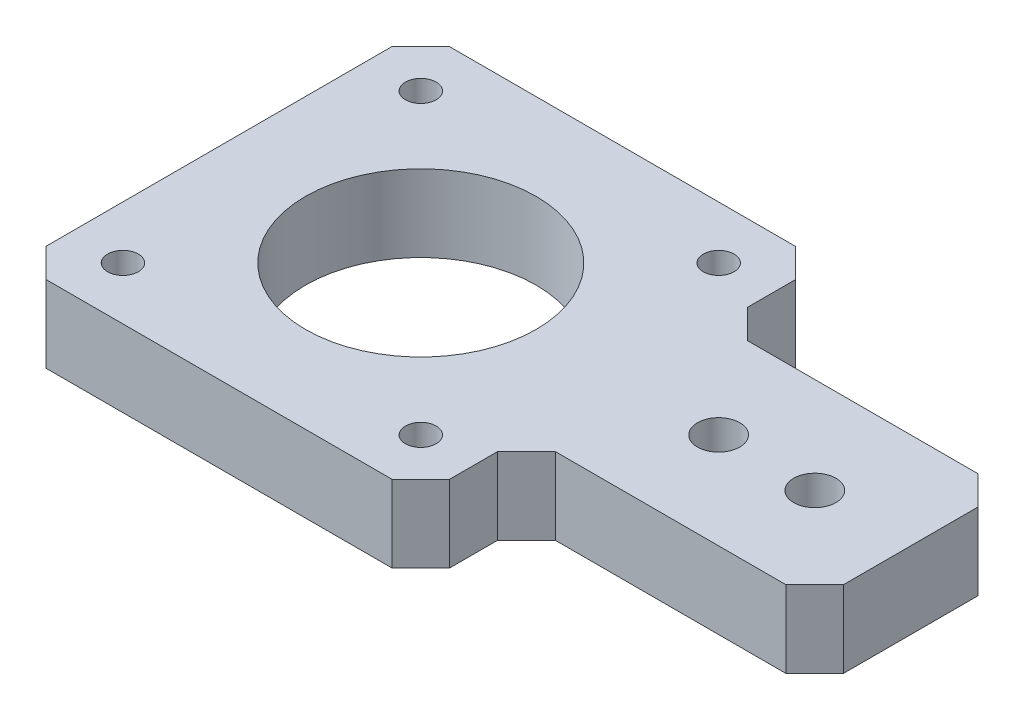
ISO-10303-21;
HEADER;
FILE_DESCRIPTION(('STEP AP214'),'2;1');
FILE_NAME('part.step','',(''),(''),'','','');
FILE_SCHEMA(('AUTOMOTIVE_DESIGN { 1 0 10303 214 1 1 1 1 }'));
ENDSEC;
DATA;
#1=APPLICATION_CONTEXT('core data for automotive mechanical design processes');
#2=APPLICATION_PROTOCOL_DEFINITION('international standard','automotive_design',2000,#1);
#3=PRODUCT_CONTEXT('',#1,'mechanical');
#4=PRODUCT('Part','Part','',(#3));
#5=PRODUCT_RELATED_PRODUCT_CATEGORY('part','',(#4));
#6=PRODUCT_DEFINITION_FORMATION('','',#4);
#7=PRODUCT_DEFINITION_CONTEXT('part definition',#1,'design');
#8=PRODUCT_DEFINITION('design','',#6,#7);
#9=PRODUCT_DEFINITION_SHAPE('','',#8);
#10=(LENGTH_UNIT() NAMED_UNIT(*) SI_UNIT(.MILLI.,.METRE.));
#11=(NAMED_UNIT(*) PLANE_ANGLE_UNIT() SI_UNIT($,.RADIAN.));
#12=(NAMED_UNIT(*) SI_UNIT($,.STERADIAN.) SOLID_ANGLE_UNIT());
#13=UNCERTAINTY_MEASURE_WITH_UNIT(LENGTH_MEASURE(1.E-05),#10,'distance_accuracy_value','');
#14=(GEOMETRIC_REPRESENTATION_CONTEXT(3) GLOBAL_UNCERTAINTY_ASSIGNED_CONTEXT((#13)) GLOBAL_UNIT_ASSIGNED_CONTEXT((#10,
#11,#12)) REPRESENTATION_CONTEXT('',''));
#15=CARTESIAN_POINT('',(0.,0.,0.));
#16=DIRECTION('',(0.,0.,1.));
#17=DIRECTION('',(1.,0.,0.));
#18=AXIS2_PLACEMENT_3D('',#15,#16,#17);
#19=CARTESIAN_POINT('',(0.,8.,0.));
#20=DIRECTION('',(0.,1.,0.));
#21=DIRECTION('',(0.,0.,1.));
#22=AXIS2_PLACEMENT_3D('',#19,#20,#21);
#23=PLANE('',#22);
#24=CARTESIAN_POINT('',(30.9981350751792,8.,0.00373449553807588));
#25=DIRECTION('',(0.,1.,0.));
#26=DIRECTION('',(0.,0.,1.));
#27=AXIS2_PLACEMENT_3D('',#24,#25,#26);
#28=CIRCLE('',#27,2.2);
#29=CARTESIAN_POINT('',(30.9981350751792,8.,2.20373449553807));
#30=VERTEX_POINT('',#29);
#31=EDGE_CURVE('E355',#30,#30,#28,.T.);
#32=ORIENTED_EDGE('',*,*,#31,.F.);
#33=EDGE_LOOP('',(#32));
#34=FACE_BOUND('',#33,.T.);
#35=CARTESIAN_POINT('',(15.5,8.,-15.5));
#36=DIRECTION('',(0.,1.,0.));
#37=DIRECTION('',(0.,0.,1.));
#38=AXIS2_PLACEMENT_3D('',#35,#36,#37);
#39=CIRCLE('',#38,1.6);
#40=CARTESIAN_POINT('',(15.5,8.,-13.9));
#41=VERTEX_POINT('',#40);
#42=EDGE_CURVE('E367',#41,#41,#39,.T.);
#43=ORIENTED_EDGE('',*,*,#42,.F.);
#44=EDGE_LOOP('',(#43));
#45=FACE_BOUND('',#44,.T.);
#46=CARTESIAN_POINT('',(-15.5,8.,15.5));
#47=DIRECTION('',(0.,1.,0.));
#48=DIRECTION('',(0.,0.,1.));
#49=AXIS2_PLACEMENT_3D('',#46,#47,#48);
#50=CIRCLE('',#49,1.6);
#51=CARTESIAN_POINT('',(-15.5,8.,17.1));
#52=VERTEX_POINT('',#51);
#53=EDGE_CURVE('E379',#52,#52,#50,.T.);
#54=ORIENTED_EDGE('',*,*,#53,.F.);
#55=EDGE_LOOP('',(#54));
#56=FACE_BOUND('',#55,.T.);
#57=DIRECTION('',(1.,0.,0.));
#58=VECTOR('',#57,1.);
#59=CARTESIAN_POINT('',(-18.,8.,21.));
#60=LINE('',#59,#58);
#61=CARTESIAN_POINT('',(-18.,8.,21.));
#62=VERTEX_POINT('',#61);
#63=CARTESIAN_POINT('',(18.,8.,21.));
#64=VERTEX_POINT('',#63);
#65=EDGE_CURVE('E209',#62,#64,#60,.T.);
#66=ORIENTED_EDGE('',*,*,#65,.T.);
#67=DIRECTION('',(0.707106781186547,0.,-0.707106781186548));
#68=VECTOR('',#67,1.);
#69=CARTESIAN_POINT('',(18.,8.,21.));
#70=LINE('',#69,#68);
#71=CARTESIAN_POINT('',(20.998132752231,8.,18.001867247769));
#72=VERTEX_POINT('',#71);
#73=EDGE_CURVE('E117',#64,#72,#70,.T.);
#74=ORIENTED_EDGE('',*,*,#73,.T.);
#75=DIRECTION('',(0.,0.,-1.));
#76=VECTOR('',#75,1.);
#77=CARTESIAN_POINT('',(20.998132752231,8.,18.001867247769));
#78=LINE('',#77,#76);
#79=CARTESIAN_POINT('',(20.9981327522309,8.,13.001867247769));
#80=VERTEX_POINT('',#79);
#81=EDGE_CURVE('E248',#72,#80,#78,.T.);
#82=ORIENTED_EDGE('',*,*,#81,.T.);
#83=DIRECTION('',(0.707106781186545,0.,-0.70710678118655));
#84=VECTOR('',#83,1.);
#85=CARTESIAN_POINT('',(20.9981327522309,8.,13.001867247769));
#86=LINE('',#85,#84);
#87=CARTESIAN_POINT('',(23.9962655044619,8.,10.003734495538));
#88=VERTEX_POINT('',#87);
#89=EDGE_CURVE('E267',#80,#88,#86,.T.);
#90=ORIENTED_EDGE('',*,*,#89,.T.);
#91=DIRECTION('',(1.,0.,0.));
#92=VECTOR('',#91,1.);
#93=CARTESIAN_POINT('',(23.9962655044619,8.,10.003734495538));
#94=LINE('',#93,#92);
#95=CARTESIAN_POINT('',(47.9962655044619,8.,10.003734495538));
#96=VERTEX_POINT('',#95);
#97=EDGE_CURVE('E264',#88,#96,#94,.T.);
#98=ORIENTED_EDGE('',*,*,#97,.T.);
#99=DIRECTION('',(0.707106781186545,0.,-0.70710678118655));
#100=VECTOR('',#99,1.);
#101=CARTESIAN_POINT('',(47.9962655044619,8.,10.003734495538));
#102=LINE('',#101,#100);
#103=CARTESIAN_POINT('',(50.9943982566929,8.,7.00560174330706));
#104=VERTEX_POINT('',#103);
#105=EDGE_CURVE('E266',#96,#104,#102,.T.);
#106=ORIENTED_EDGE('',*,*,#105,.T.);
#107=DIRECTION('',(0.,0.,-1.));
#108=VECTOR('',#107,1.);
#109=CARTESIAN_POINT('',(50.9943982566929,8.,7.00560174330706));
#110=LINE('',#109,#108);
#111=CARTESIAN_POINT('',(50.9943982566929,8.,-6.9943982566929));
#112=VERTEX_POINT('',#111);
#113=EDGE_CURVE('E269',#104,#112,#110,.T.);
#114=ORIENTED_EDGE('',*,*,#113,.T.);
#115=DIRECTION('',(-0.707106781186552,0.,-0.707106781186543));
#116=VECTOR('',#115,1.);
#117=CARTESIAN_POINT('',(50.9943982566929,8.,-6.9943982566929));
#118=LINE('',#117,#116);
#119=CARTESIAN_POINT('',(47.9962655044619,8.,-9.99253100892381));
#120=VERTEX_POINT('',#119);
#121=EDGE_CURVE('E275',#112,#120,#118,.T.);
#122=ORIENTED_EDGE('',*,*,#121,.T.);
#123=DIRECTION('',(-1.,0.,0.));
#124=VECTOR('',#123,1.);
#125=CARTESIAN_POINT('',(47.9962655044619,8.,-9.99253100892381));
#126=LINE('',#125,#124);
#127=CARTESIAN_POINT('',(23.9962655044619,8.,-9.99253100892381));
#128=VERTEX_POINT('',#127);
#129=EDGE_CURVE('E277',#120,#128,#126,.T.);
#130=ORIENTED_EDGE('',*,*,#129,.T.);
#131=DIRECTION('',(-0.707106781186554,0.,-0.707106781186541));
#132=VECTOR('',#131,1.);
#133=CARTESIAN_POINT('',(23.9962655044619,8.,-9.99253100892381));
#134=LINE('',#133,#132);
#135=CARTESIAN_POINT('',(20.998132752231,8.,-12.9906637611547));
#136=VERTEX_POINT('',#135);
#137=EDGE_CURVE('E279',#128,#136,#134,.T.);
#138=ORIENTED_EDGE('',*,*,#137,.T.);
#139=DIRECTION('',(0.,0.,-1.));
#140=VECTOR('',#139,1.);
#141=CARTESIAN_POINT('',(20.998132752231,8.,-12.9906637611547));
#142=LINE('',#141,#140);
#143=CARTESIAN_POINT('',(20.998132752231,8.,-17.9906637611548));
#144=VERTEX_POINT('',#143);
#145=EDGE_CURVE('E281',#136,#144,#142,.T.);
#146=ORIENTED_EDGE('',*,*,#145,.T.);
#147=DIRECTION('',(-0.707106781186554,0.,-0.707106781186541));
#148=VECTOR('',#147,1.);
#149=CARTESIAN_POINT('',(20.998132752231,8.,-17.9906637611548));
#150=LINE('',#149,#148);
#151=CARTESIAN_POINT('',(18.,8.,-20.9887965133857));
#152=VERTEX_POINT('',#151);
#153=EDGE_CURVE('E283',#144,#152,#150,.T.);
#154=ORIENTED_EDGE('',*,*,#153,.T.);
#155=DIRECTION('',(-1.,0.,0.));
#156=VECTOR('',#155,1.);
#157=CARTESIAN_POINT('',(18.,8.,-20.9887965133857));
#158=LINE('',#157,#156);
#159=CARTESIAN_POINT('',(-18.,8.,-20.9887965133857));
#160=VERTEX_POINT('',#159);
#161=EDGE_CURVE('E160',#152,#160,#158,.T.);
#162=ORIENTED_EDGE('',*,*,#161,.T.);
#163=DIRECTION('',(-0.707986458603764,0.,0.706226008041123));
#164=VECTOR('',#163,1.);
#165=CARTESIAN_POINT('',(-18.,8.,-20.9887965133857));
#166=LINE('',#165,#164);
#167=CARTESIAN_POINT('',(-21.0018695707173,8.,-17.9943912704257));
#168=VERTEX_POINT('',#167);
#169=EDGE_CURVE('E154',#160,#168,#166,.T.);
#170=ORIENTED_EDGE('',*,*,#169,.T.);
#171=DIRECTION('',(0.,0.,1.));
#172=VECTOR('',#171,1.);
#173=CARTESIAN_POINT('',(-21.0018695707173,8.,-17.9943912704257));
#174=LINE('',#173,#172);
#175=CARTESIAN_POINT('',(-21.0018695707173,8.,18.0056087295743));
#176=VERTEX_POINT('',#175);
#177=EDGE_CURVE('E158',#168,#176,#174,.T.);
#178=ORIENTED_EDGE('',*,*,#177,.T.);
#179=DIRECTION('',(0.707988106301255,0.,0.706224356232467));
#180=VECTOR('',#179,1.);
#181=CARTESIAN_POINT('',(-21.0018695707173,8.,18.0056087295743));
#182=LINE('',#181,#180);
#183=EDGE_CURVE('E50',#176,#62,#182,.T.);
#184=ORIENTED_EDGE('',*,*,#183,.T.);
#185=EDGE_LOOP('',(#66,#74,#82,#90,#98,#106,#114,#122,#130,#138,#146,#154,#162,#170,#178,#184));
#186=FACE_BOUND('',#185,.T.);
#187=CARTESIAN_POINT('',(0.,8.,0.));
#188=DIRECTION('',(0.,1.,0.));
#189=DIRECTION('',(0.,0.,1.));
#190=AXIS2_PLACEMENT_3D('',#187,#188,#189);
#191=CIRCLE('',#190,12.);
#192=CARTESIAN_POINT('',(0.,8.,12.));
#193=VERTEX_POINT('',#192);
#194=EDGE_CURVE('E182',#193,#193,#191,.T.);
#195=ORIENTED_EDGE('',*,*,#194,.F.);
#196=EDGE_LOOP('',(#195));
#197=FACE_BOUND('',#196,.T.);
#198=CARTESIAN_POINT('',(-15.5,8.,-15.5));
#199=DIRECTION('',(0.,1.,0.));
#200=DIRECTION('',(0.,0.,1.));
#201=AXIS2_PLACEMENT_3D('',#198,#199,#200);
#202=CIRCLE('',#201,1.6);
#203=CARTESIAN_POINT('',(-15.5,8.,-13.9));
#204=VERTEX_POINT('',#203);
#205=EDGE_CURVE('E373',#204,#204,#202,.T.);
#206=ORIENTED_EDGE('',*,*,#205,.F.);
#207=EDGE_LOOP('',(#206));
#208=FACE_BOUND('',#207,.T.);
#209=CARTESIAN_POINT('',(15.5,8.,15.5));
#210=DIRECTION('',(0.,1.,0.));
#211=DIRECTION('',(0.,0.,1.));
#212=AXIS2_PLACEMENT_3D('',#209,#210,#211);
#213=CIRCLE('',#212,1.6);
#214=CARTESIAN_POINT('',(15.5,8.,17.1));
#215=VERTEX_POINT('',#214);
#216=EDGE_CURVE('E361',#215,#215,#213,.T.);
#217=ORIENTED_EDGE('',*,*,#216,.F.);
#218=EDGE_LOOP('',(#217));
#219=FACE_BOUND('',#218,.T.);
#220=CARTESIAN_POINT('',(41.0081350751792,8.,0.00373449553807588));
#221=DIRECTION('',(0.,1.,0.));
#222=DIRECTION('',(0.,0.,1.));
#223=AXIS2_PLACEMENT_3D('',#220,#221,#222);
#224=CIRCLE('',#223,2.2);
#225=CARTESIAN_POINT('',(41.0081350751792,8.,2.20373449553807));
#226=VERTEX_POINT('',#225);
#227=EDGE_CURVE('E346',#226,#226,#224,.T.);
#228=ORIENTED_EDGE('',*,*,#227,.F.);
#229=EDGE_LOOP('',(#228));
#230=FACE_BOUND('',#229,.T.);
#231=ADVANCED_FACE('F33',(#34,#45,#56,#186,#197,#208,#219,#230),#23,.T.);
#232=CARTESIAN_POINT('',(0.,0.,0.));
#233=DIRECTION('',(0.,1.,0.));
#234=DIRECTION('',(0.,0.,1.));
#235=AXIS2_PLACEMENT_3D('',#232,#233,#234);
#236=PLANE('',#235);
#237=DIRECTION('',(1.,0.,0.));
#238=VECTOR('',#237,1.);
#239=CARTESIAN_POINT('',(-18.,0.,21.));
#240=LINE('',#239,#238);
#241=CARTESIAN_POINT('',(-18.,0.,21.));
#242=VERTEX_POINT('',#241);
#243=CARTESIAN_POINT('',(18.,0.,21.));
#244=VERTEX_POINT('',#243);
#245=EDGE_CURVE('E178',#242,#244,#240,.T.);
#246=ORIENTED_EDGE('',*,*,#245,.F.);
#247=DIRECTION('',(0.707988106301255,0.,0.706224356232467));
#248=VECTOR('',#247,1.);
#249=CARTESIAN_POINT('',(-21.0018695707173,0.,18.0056087295743));
#250=LINE('',#249,#248);
#251=CARTESIAN_POINT('',(-21.0018695707173,0.,18.0056087295743));
#252=VERTEX_POINT('',#251);
#253=EDGE_CURVE('E109',#252,#242,#250,.T.);
#254=ORIENTED_EDGE('',*,*,#253,.F.);
#255=DIRECTION('',(0.,0.,1.));
#256=VECTOR('',#255,1.);
#257=CARTESIAN_POINT('',(-21.0018695707173,0.,-17.9943912704257));
#258=LINE('',#257,#256);
#259=CARTESIAN_POINT('',(-21.0018695707173,0.,-17.9943912704257));
#260=VERTEX_POINT('',#259);
#261=EDGE_CURVE('E103',#260,#252,#258,.T.);
#262=ORIENTED_EDGE('',*,*,#261,.F.);
#263=DIRECTION('',(-0.707986458603764,0.,0.706226008041123));
#264=VECTOR('',#263,1.);
#265=CARTESIAN_POINT('',(-18.,0.,-20.9887965133857));
#266=LINE('',#265,#264);
#267=CARTESIAN_POINT('',(-18.,0.,-20.9887965133857));
#268=VERTEX_POINT('',#267);
#269=EDGE_CURVE('E168',#268,#260,#266,.T.);
#270=ORIENTED_EDGE('',*,*,#269,.F.);
#271=DIRECTION('',(-1.,0.,0.));
#272=VECTOR('',#271,1.);
#273=CARTESIAN_POINT('',(18.,0.,-20.9887965133857));
#274=LINE('',#273,#272);
#275=CARTESIAN_POINT('',(18.,0.,-20.9887965133857));
#276=VERTEX_POINT('',#275);
#277=EDGE_CURVE('E204',#276,#268,#274,.T.);
#278=ORIENTED_EDGE('',*,*,#277,.F.);
#279=DIRECTION('',(-0.707106781186554,0.,-0.707106781186541));
#280=VECTOR('',#279,1.);
#281=CARTESIAN_POINT('',(20.998132752231,0.,-17.9906637611548));
#282=LINE('',#281,#280);
#283=CARTESIAN_POINT('',(20.998132752231,0.,-17.9906637611548));
#284=VERTEX_POINT('',#283);
#285=EDGE_CURVE('E202',#284,#276,#282,.T.);
#286=ORIENTED_EDGE('',*,*,#285,.F.);
#287=DIRECTION('',(0.,0.,-1.));
#288=VECTOR('',#287,1.);
#289=CARTESIAN_POINT('',(20.998132752231,0.,-12.9906637611547));
#290=LINE('',#289,#288);
#291=CARTESIAN_POINT('',(20.998132752231,0.,-12.9906637611547));
#292=VERTEX_POINT('',#291);
#293=EDGE_CURVE('E200',#292,#284,#290,.T.);
#294=ORIENTED_EDGE('',*,*,#293,.F.);
#295=DIRECTION('',(-0.707106781186554,0.,-0.707106781186541));
#296=VECTOR('',#295,1.);
#297=CARTESIAN_POINT('',(23.9962655044619,0.,-9.99253100892381));
#298=LINE('',#297,#296);
#299=CARTESIAN_POINT('',(23.9962655044619,0.,-9.99253100892381));
#300=VERTEX_POINT('',#299);
#301=EDGE_CURVE('E198',#300,#292,#298,.T.);
#302=ORIENTED_EDGE('',*,*,#301,.F.);
#303=DIRECTION('',(-1.,0.,0.));
#304=VECTOR('',#303,1.);
#305=CARTESIAN_POINT('',(47.9962655044619,0.,-9.99253100892381));
#306=LINE('',#305,#304);
#307=CARTESIAN_POINT('',(47.9962655044619,0.,-9.99253100892381));
#308=VERTEX_POINT('',#307);
#309=EDGE_CURVE('E196',#308,#300,#306,.T.);
#310=ORIENTED_EDGE('',*,*,#309,.F.);
#311=DIRECTION('',(-0.707106781186552,0.,-0.707106781186543));
#312=VECTOR('',#311,1.);
#313=CARTESIAN_POINT('',(50.9943982566929,0.,-6.9943982566929));
#314=LINE('',#313,#312);
#315=CARTESIAN_POINT('',(50.9943982566929,0.,-6.9943982566929));
#316=VERTEX_POINT('',#315);
#317=EDGE_CURVE('E194',#316,#308,#314,.T.);
#318=ORIENTED_EDGE('',*,*,#317,.F.);
#319=DIRECTION('',(0.,0.,-1.));
#320=VECTOR('',#319,1.);
#321=CARTESIAN_POINT('',(50.9943982566929,0.,7.00560174330706));
#322=LINE('',#321,#320);
#323=CARTESIAN_POINT('',(50.9943982566929,0.,7.00560174330706));
#324=VERTEX_POINT('',#323);
#325=EDGE_CURVE('E192',#324,#316,#322,.T.);
#326=ORIENTED_EDGE('',*,*,#325,.F.);
#327=DIRECTION('',(0.707106781186545,0.,-0.70710678118655));
#328=VECTOR('',#327,1.);
#329=CARTESIAN_POINT('',(47.9962655044619,0.,10.003734495538));
#330=LINE('',#329,#328);
#331=CARTESIAN_POINT('',(47.9962655044619,0.,10.003734495538));
#332=VERTEX_POINT('',#331);
#333=EDGE_CURVE('E190',#332,#324,#330,.T.);
#334=ORIENTED_EDGE('',*,*,#333,.F.);
#335=DIRECTION('',(1.,0.,0.));
#336=VECTOR('',#335,1.);
#337=CARTESIAN_POINT('',(23.9962655044619,0.,10.003734495538));
#338=LINE('',#337,#336);
#339=CARTESIAN_POINT('',(23.9962655044619,0.,10.003734495538));
#340=VERTEX_POINT('',#339);
#341=EDGE_CURVE('E188',#340,#332,#338,.T.);
#342=ORIENTED_EDGE('',*,*,#341,.F.);
#343=DIRECTION('',(0.707106781186545,0.,-0.70710678118655));
#344=VECTOR('',#343,1.);
#345=CARTESIAN_POINT('',(20.9981327522309,0.,13.001867247769));
#346=LINE('',#345,#344);
#347=CARTESIAN_POINT('',(20.9981327522309,0.,13.001867247769));
#348=VERTEX_POINT('',#347);
#349=EDGE_CURVE('E186',#348,#340,#346,.T.);
#350=ORIENTED_EDGE('',*,*,#349,.F.);
#351=DIRECTION('',(0.,0.,-1.));
#352=VECTOR('',#351,1.);
#353=CARTESIAN_POINT('',(20.998132752231,0.,18.001867247769));
#354=LINE('',#353,#352);
#355=CARTESIAN_POINT('',(20.998132752231,0.,18.001867247769));
#356=VERTEX_POINT('',#355);
#357=EDGE_CURVE('E184',#356,#348,#354,.T.);
#358=ORIENTED_EDGE('',*,*,#357,.F.);
#359=DIRECTION('',(0.707106781186547,0.,-0.707106781186548));
#360=VECTOR('',#359,1.);
#361=CARTESIAN_POINT('',(18.,0.,21.));
#362=LINE('',#361,#360);
#363=EDGE_CURVE('E181',#244,#356,#362,.T.);
#364=ORIENTED_EDGE('',*,*,#363,.F.);
#365=EDGE_LOOP('',(#246,#254,#262,#270,#278,#286,#294,#302,#310,#318,#326,#334,#342,#350,#358,#364));
#366=FACE_BOUND('',#365,.T.);
#367=CARTESIAN_POINT('',(0.,0.,0.));
#368=DIRECTION('',(0.,1.,0.));
#369=DIRECTION('',(0.,0.,1.));
#370=AXIS2_PLACEMENT_3D('',#367,#368,#369);
#371=CIRCLE('',#370,12.);
#372=CARTESIAN_POINT('',(0.,0.,12.));
#373=VERTEX_POINT('',#372);
#374=EDGE_CURVE('E382',#373,#373,#371,.T.);
#375=ORIENTED_EDGE('',*,*,#374,.T.);
#376=EDGE_LOOP('',(#375));
#377=FACE_BOUND('',#376,.T.);
#378=CARTESIAN_POINT('',(-15.5,0.,15.5));
#379=DIRECTION('',(0.,1.,0.));
#380=DIRECTION('',(0.,0.,1.));
#381=AXIS2_PLACEMENT_3D('',#378,#379,#380);
#382=CIRCLE('',#381,1.6);
#383=CARTESIAN_POINT('',(-15.5,0.,17.1));
#384=VERTEX_POINT('',#383);
#385=EDGE_CURVE('E376',#384,#384,#382,.T.);
#386=ORIENTED_EDGE('',*,*,#385,.T.);
#387=EDGE_LOOP('',(#386));
#388=FACE_BOUND('',#387,.T.);
#389=CARTESIAN_POINT('',(-15.5,0.,-15.5));
#390=DIRECTION('',(0.,1.,0.));
#391=DIRECTION('',(0.,0.,1.));
#392=AXIS2_PLACEMENT_3D('',#389,#390,#391);
#393=CIRCLE('',#392,1.6);
#394=CARTESIAN_POINT('',(-15.5,0.,-13.9));
#395=VERTEX_POINT('',#394);
#396=EDGE_CURVE('E370',#395,#395,#393,.T.);
#397=ORIENTED_EDGE('',*,*,#396,.T.);
#398=EDGE_LOOP('',(#397));
#399=FACE_BOUND('',#398,.T.);
#400=CARTESIAN_POINT('',(15.5,0.,-15.5));
#401=DIRECTION('',(0.,1.,0.));
#402=DIRECTION('',(0.,0.,1.));
#403=AXIS2_PLACEMENT_3D('',#400,#401,#402);
#404=CIRCLE('',#403,1.6);
#405=CARTESIAN_POINT('',(15.5,0.,-13.9));
#406=VERTEX_POINT('',#405);
#407=EDGE_CURVE('E364',#406,#406,#404,.T.);
#408=ORIENTED_EDGE('',*,*,#407,.T.);
#409=EDGE_LOOP('',(#408));
#410=FACE_BOUND('',#409,.T.);
#411=CARTESIAN_POINT('',(15.5,0.,15.5));
#412=DIRECTION('',(0.,1.,0.));
#413=DIRECTION('',(0.,0.,1.));
#414=AXIS2_PLACEMENT_3D('',#411,#412,#413);
#415=CIRCLE('',#414,1.6);
#416=CARTESIAN_POINT('',(15.5,0.,17.1));
#417=VERTEX_POINT('',#416);
#418=EDGE_CURVE('E358',#417,#417,#415,.T.);
#419=ORIENTED_EDGE('',*,*,#418,.T.);
#420=EDGE_LOOP('',(#419));
#421=FACE_BOUND('',#420,.T.);
#422=CARTESIAN_POINT('',(30.9981350751792,0.,0.00373449553807588));
#423=DIRECTION('',(0.,1.,0.));
#424=DIRECTION('',(0.,0.,1.));
#425=AXIS2_PLACEMENT_3D('',#422,#423,#424);
#426=CIRCLE('',#425,2.2);
#427=CARTESIAN_POINT('',(30.9981350751792,0.,2.20373449553807));
#428=VERTEX_POINT('',#427);
#429=EDGE_CURVE('E352',#428,#428,#426,.T.);
#430=ORIENTED_EDGE('',*,*,#429,.T.);
#431=EDGE_LOOP('',(#430));
#432=FACE_BOUND('',#431,.T.);
#433=CARTESIAN_POINT('',(41.0081350751792,0.,0.00373449553807588));
#434=DIRECTION('',(0.,1.,0.));
#435=DIRECTION('',(0.,0.,1.));
#436=AXIS2_PLACEMENT_3D('',#433,#434,#435);
#437=CIRCLE('',#436,2.2);
#438=CARTESIAN_POINT('',(41.0081350751792,0.,2.20373449553807));
#439=VERTEX_POINT('',#438);
#440=EDGE_CURVE('E349',#439,#439,#437,.T.);
#441=ORIENTED_EDGE('',*,*,#440,.T.);
#442=EDGE_LOOP('',(#441));
#443=FACE_BOUND('',#442,.T.);
#444=ADVANCED_FACE('F252',(#366,#377,#388,#399,#410,#421,#432,#443),#236,.F.);
#445=CARTESIAN_POINT('',(-18.,8.,21.));
#446=DIRECTION('',(0.,0.,-1.));
#447=DIRECTION('',(-1.,0.,0.));
#448=AXIS2_PLACEMENT_3D('',#445,#446,#447);
#449=PLANE('',#448);
#450=ORIENTED_EDGE('',*,*,#245,.T.);
#451=DIRECTION('',(0.,-1.,0.));
#452=VECTOR('',#451,1.);
#453=CARTESIAN_POINT('',(18.,8.,21.));
#454=LINE('',#453,#452);
#455=EDGE_CURVE('E11',#64,#244,#454,.T.);
#456=ORIENTED_EDGE('',*,*,#455,.F.);
#457=ORIENTED_EDGE('',*,*,#65,.F.);
#458=DIRECTION('',(0.,-1.,0.));
#459=VECTOR('',#458,1.);
#460=CARTESIAN_POINT('',(-18.,8.,21.));
#461=LINE('',#460,#459);
#462=EDGE_CURVE('E174',#62,#242,#461,.T.);
#463=ORIENTED_EDGE('',*,*,#462,.T.);
#464=EDGE_LOOP('',(#450,#456,#457,#463));
#465=FACE_BOUND('',#464,.T.);
#466=ADVANCED_FACE('F35',(#465),#449,.F.);
#467=CARTESIAN_POINT('',(18.,8.,21.));
#468=DIRECTION('',(-0.707106781186548,0.,-0.707106781186547));
#469=DIRECTION('',(-0.707106781186547,0.,0.707106781186548));
#470=AXIS2_PLACEMENT_3D('',#467,#468,#469);
#471=PLANE('',#470);
#472=ORIENTED_EDGE('',*,*,#363,.T.);
#473=DIRECTION('',(0.,-1.,0.));
#474=VECTOR('',#473,1.);
#475=CARTESIAN_POINT('',(20.998132752231,8.,18.001867247769));
#476=LINE('',#475,#474);
#477=EDGE_CURVE('E42',#72,#356,#476,.T.);
#478=ORIENTED_EDGE('',*,*,#477,.F.);
#479=ORIENTED_EDGE('',*,*,#73,.F.);
#480=ORIENTED_EDGE('',*,*,#455,.T.);
#481=EDGE_LOOP('',(#472,#478,#479,#480));
#482=FACE_BOUND('',#481,.T.);
#483=ADVANCED_FACE('F559',(#482),#471,.F.);
#484=CARTESIAN_POINT('',(20.998132752231,8.,18.001867247769));
#485=DIRECTION('',(-1.,0.,0.));
#486=DIRECTION('',(0.,0.,1.));
#487=AXIS2_PLACEMENT_3D('',#484,#485,#486);
#488=PLANE('',#487);
#489=ORIENTED_EDGE('',*,*,#357,.T.);
#490=DIRECTION('',(0.,-1.,0.));
#491=VECTOR('',#490,1.);
#492=CARTESIAN_POINT('',(20.9981327522309,8.,13.001867247769));
#493=LINE('',#492,#491);
#494=EDGE_CURVE('E240',#80,#348,#493,.T.);
#495=ORIENTED_EDGE('',*,*,#494,.F.);
#496=ORIENTED_EDGE('',*,*,#81,.F.);
#497=ORIENTED_EDGE('',*,*,#477,.T.);
#498=EDGE_LOOP('',(#489,#495,#496,#497));
#499=FACE_BOUND('',#498,.T.);
#500=ADVANCED_FACE('F246',(#499),#488,.F.);
#501=CARTESIAN_POINT('',(20.9981327522309,8.,13.001867247769));
#502=DIRECTION('',(-0.70710678118655,0.,-0.707106781186545));
#503=DIRECTION('',(-0.707106781186545,0.,0.70710678118655));
#504=AXIS2_PLACEMENT_3D('',#501,#502,#503);
#505=PLANE('',#504);
#506=ORIENTED_EDGE('',*,*,#349,.T.);
#507=DIRECTION('',(0.,-1.,0.));
#508=VECTOR('',#507,1.);
#509=CARTESIAN_POINT('',(23.9962655044619,8.,10.003734495538));
#510=LINE('',#509,#508);
#511=EDGE_CURVE('E237',#88,#340,#510,.T.);
#512=ORIENTED_EDGE('',*,*,#511,.F.);
#513=ORIENTED_EDGE('',*,*,#89,.F.);
#514=ORIENTED_EDGE('',*,*,#494,.T.);
#515=EDGE_LOOP('',(#506,#512,#513,#514));
#516=FACE_BOUND('',#515,.T.);
#517=ADVANCED_FACE('F258',(#516),#505,.F.);
#518=CARTESIAN_POINT('',(23.9962655044619,8.,10.003734495538));
#519=DIRECTION('',(0.,0.,-1.));
#520=DIRECTION('',(-1.,0.,0.));
#521=AXIS2_PLACEMENT_3D('',#518,#519,#520);
#522=PLANE('',#521);
#523=ORIENTED_EDGE('',*,*,#341,.T.);
#524=DIRECTION('',(0.,-1.,0.));
#525=VECTOR('',#524,1.);
#526=CARTESIAN_POINT('',(47.9962655044619,8.,10.003734495538));
#527=LINE('',#526,#525);
#528=EDGE_CURVE('E234',#96,#332,#527,.T.);
#529=ORIENTED_EDGE('',*,*,#528,.F.);
#530=ORIENTED_EDGE('',*,*,#97,.F.);
#531=ORIENTED_EDGE('',*,*,#511,.T.);
#532=EDGE_LOOP('',(#523,#529,#530,#531));
#533=FACE_BOUND('',#532,.T.);
#534=ADVANCED_FACE('F262',(#533),#522,.F.);
#535=CARTESIAN_POINT('',(47.9962655044619,8.,10.003734495538));
#536=DIRECTION('',(-0.70710678118655,0.,-0.707106781186545));
#537=DIRECTION('',(-0.707106781186545,0.,0.70710678118655));
#538=AXIS2_PLACEMENT_3D('',#535,#536,#537);
#539=PLANE('',#538);
#540=ORIENTED_EDGE('',*,*,#333,.T.);
#541=DIRECTION('',(0.,-1.,0.));
#542=VECTOR('',#541,1.);
#543=CARTESIAN_POINT('',(50.9943982566929,8.,7.00560174330706));
#544=LINE('',#543,#542);
#545=EDGE_CURVE('E231',#104,#324,#544,.T.);
#546=ORIENTED_EDGE('',*,*,#545,.F.);
#547=ORIENTED_EDGE('',*,*,#105,.F.);
#548=ORIENTED_EDGE('',*,*,#528,.T.);
#549=EDGE_LOOP('',(#540,#546,#547,#548));
#550=FACE_BOUND('',#549,.T.);
#551=ADVANCED_FACE('F524',(#550),#539,.F.);
#552=CARTESIAN_POINT('',(50.9943982566929,8.,7.00560174330706));
#553=DIRECTION('',(-1.,0.,0.));
#554=DIRECTION('',(0.,0.,1.));
#555=AXIS2_PLACEMENT_3D('',#552,#553,#554);
#556=PLANE('',#555);
#557=ORIENTED_EDGE('',*,*,#325,.T.);
#558=DIRECTION('',(0.,-1.,0.));
#559=VECTOR('',#558,1.);
#560=CARTESIAN_POINT('',(50.9943982566929,8.,-6.9943982566929));
#561=LINE('',#560,#559);
#562=EDGE_CURVE('E228',#112,#316,#561,.T.);
#563=ORIENTED_EDGE('',*,*,#562,.F.);
#564=ORIENTED_EDGE('',*,*,#113,.F.);
#565=ORIENTED_EDGE('',*,*,#545,.T.);
#566=EDGE_LOOP('',(#557,#563,#564,#565));
#567=FACE_BOUND('',#566,.T.);
#568=ADVANCED_FACE('F514',(#567),#556,.F.);
#569=CARTESIAN_POINT('',(50.9943982566929,8.,-6.9943982566929));
#570=DIRECTION('',(-0.707106781186543,0.,0.707106781186552));
#571=DIRECTION('',(0.707106781186552,0.,0.707106781186543));
#572=AXIS2_PLACEMENT_3D('',#569,#570,#571);
#573=PLANE('',#572);
#574=ORIENTED_EDGE('',*,*,#317,.T.);
#575=DIRECTION('',(0.,-1.,0.));
#576=VECTOR('',#575,1.);
#577=CARTESIAN_POINT('',(47.9962655044619,8.,-9.99253100892381));
#578=LINE('',#577,#576);
#579=EDGE_CURVE('E225',#120,#308,#578,.T.);
#580=ORIENTED_EDGE('',*,*,#579,.F.);
#581=ORIENTED_EDGE('',*,*,#121,.F.);
#582=ORIENTED_EDGE('',*,*,#562,.T.);
#583=EDGE_LOOP('',(#574,#580,#581,#582));
#584=FACE_BOUND('',#583,.T.);
#585=ADVANCED_FACE('F504',(#584),#573,.F.);
#586=CARTESIAN_POINT('',(47.9962655044619,8.,-9.99253100892381));
#587=DIRECTION('',(0.,0.,1.));
#588=DIRECTION('',(1.,0.,0.));
#589=AXIS2_PLACEMENT_3D('',#586,#587,#588);
#590=PLANE('',#589);
#591=ORIENTED_EDGE('',*,*,#309,.T.);
#592=DIRECTION('',(0.,-1.,0.));
#593=VECTOR('',#592,1.);
#594=CARTESIAN_POINT('',(23.9962655044619,8.,-9.99253100892381));
#595=LINE('',#594,#593);
#596=EDGE_CURVE('E222',#128,#300,#595,.T.);
#597=ORIENTED_EDGE('',*,*,#596,.F.);
#598=ORIENTED_EDGE('',*,*,#129,.F.);
#599=ORIENTED_EDGE('',*,*,#579,.T.);
#600=EDGE_LOOP('',(#591,#597,#598,#599));
#601=FACE_BOUND('',#600,.T.);
#602=ADVANCED_FACE('F494',(#601),#590,.F.);
#603=CARTESIAN_POINT('',(23.9962655044619,8.,-9.99253100892381));
#604=DIRECTION('',(-0.707106781186541,0.,0.707106781186554));
#605=DIRECTION('',(0.707106781186554,0.,0.707106781186541));
#606=AXIS2_PLACEMENT_3D('',#603,#604,#605);
#607=PLANE('',#606);
#608=ORIENTED_EDGE('',*,*,#301,.T.);
#609=DIRECTION('',(0.,-1.,0.));
#610=VECTOR('',#609,1.);
#611=CARTESIAN_POINT('',(20.998132752231,8.,-12.9906637611547));
#612=LINE('',#611,#610);
#613=EDGE_CURVE('E219',#136,#292,#612,.T.);
#614=ORIENTED_EDGE('',*,*,#613,.F.);
#615=ORIENTED_EDGE('',*,*,#137,.F.);
#616=ORIENTED_EDGE('',*,*,#596,.T.);
#617=EDGE_LOOP('',(#608,#614,#615,#616));
#618=FACE_BOUND('',#617,.T.);
#619=ADVANCED_FACE('F484',(#618),#607,.F.);
#620=CARTESIAN_POINT('',(20.998132752231,8.,-12.9906637611547));
#621=DIRECTION('',(-1.,0.,0.));
#622=DIRECTION('',(0.,0.,1.));
#623=AXIS2_PLACEMENT_3D('',#620,#621,#622);
#624=PLANE('',#623);
#625=ORIENTED_EDGE('',*,*,#293,.T.);
#626=DIRECTION('',(0.,-1.,0.));
#627=VECTOR('',#626,1.);
#628=CARTESIAN_POINT('',(20.998132752231,8.,-17.9906637611548));
#629=LINE('',#628,#627);
#630=EDGE_CURVE('E216',#144,#284,#629,.T.);
#631=ORIENTED_EDGE('',*,*,#630,.F.);
#632=ORIENTED_EDGE('',*,*,#145,.F.);
#633=ORIENTED_EDGE('',*,*,#613,.T.);
#634=EDGE_LOOP('',(#625,#631,#632,#633));
#635=FACE_BOUND('',#634,.T.);
#636=ADVANCED_FACE('F475',(#635),#624,.F.);
#637=CARTESIAN_POINT('',(20.998132752231,8.,-17.9906637611548));
#638=DIRECTION('',(-0.707106781186541,0.,0.707106781186554));
#639=DIRECTION('',(0.707106781186554,0.,0.707106781186541));
#640=AXIS2_PLACEMENT_3D('',#637,#638,#639);
#641=PLANE('',#640);
#642=ORIENTED_EDGE('',*,*,#285,.T.);
#643=DIRECTION('',(0.,-1.,0.));
#644=VECTOR('',#643,1.);
#645=CARTESIAN_POINT('',(18.,8.,-20.9887965133857));
#646=LINE('',#645,#644);
#647=EDGE_CURVE('E213',#152,#276,#646,.T.);
#648=ORIENTED_EDGE('',*,*,#647,.F.);
#649=ORIENTED_EDGE('',*,*,#153,.F.);
#650=ORIENTED_EDGE('',*,*,#630,.T.);
#651=EDGE_LOOP('',(#642,#648,#649,#650));
#652=FACE_BOUND('',#651,.T.);
#653=ADVANCED_FACE('F289',(#652),#641,.F.);
#654=CARTESIAN_POINT('',(18.,8.,-20.9887965133857));
#655=DIRECTION('',(0.,0.,1.));
#656=DIRECTION('',(1.,0.,0.));
#657=AXIS2_PLACEMENT_3D('',#654,#655,#656);
#658=PLANE('',#657);
#659=ORIENTED_EDGE('',*,*,#277,.T.);
#660=DIRECTION('',(0.,-1.,0.));
#661=VECTOR('',#660,1.);
#662=CARTESIAN_POINT('',(-18.,8.,-20.9887965133857));
#663=LINE('',#662,#661);
#664=EDGE_CURVE('E169',#160,#268,#663,.T.);
#665=ORIENTED_EDGE('',*,*,#664,.F.);
#666=ORIENTED_EDGE('',*,*,#161,.F.);
#667=ORIENTED_EDGE('',*,*,#647,.T.);
#668=EDGE_LOOP('',(#659,#665,#666,#667));
#669=FACE_BOUND('',#668,.T.);
#670=ADVANCED_FACE('F293',(#669),#658,.F.);
#671=CARTESIAN_POINT('',(-18.,8.,-20.9887965133857));
#672=DIRECTION('',(0.706226008041123,0.,0.707986458603764));
#673=DIRECTION('',(0.707986458603764,0.,-0.706226008041123));
#674=AXIS2_PLACEMENT_3D('',#671,#672,#673);
#675=PLANE('',#674);
#676=ORIENTED_EDGE('',*,*,#269,.T.);
#677=DIRECTION('',(0.,-1.,0.));
#678=VECTOR('',#677,1.);
#679=CARTESIAN_POINT('',(-21.0018695707173,8.,-17.9943912704257));
#680=LINE('',#679,#678);
#681=EDGE_CURVE('E165',#168,#260,#680,.T.);
#682=ORIENTED_EDGE('',*,*,#681,.F.);
#683=ORIENTED_EDGE('',*,*,#169,.F.);
#684=ORIENTED_EDGE('',*,*,#664,.T.);
#685=EDGE_LOOP('',(#676,#682,#683,#684));
#686=FACE_BOUND('',#685,.T.);
#687=ADVANCED_FACE('F166',(#686),#675,.F.);
#688=CARTESIAN_POINT('',(-21.0018695707173,8.,-17.9943912704257));
#689=DIRECTION('',(1.,0.,0.));
#690=DIRECTION('',(0.,0.,-1.));
#691=AXIS2_PLACEMENT_3D('',#688,#689,#690);
#692=PLANE('',#691);
#693=ORIENTED_EDGE('',*,*,#261,.T.);
#694=DIRECTION('',(0.,-1.,0.));
#695=VECTOR('',#694,1.);
#696=CARTESIAN_POINT('',(-21.0018695707173,8.,18.0056087295743));
#697=LINE('',#696,#695);
#698=EDGE_CURVE('E170',#176,#252,#697,.T.);
#699=ORIENTED_EDGE('',*,*,#698,.F.);
#700=ORIENTED_EDGE('',*,*,#177,.F.);
#701=ORIENTED_EDGE('',*,*,#681,.T.);
#702=EDGE_LOOP('',(#693,#699,#700,#701));
#703=FACE_BOUND('',#702,.T.);
#704=ADVANCED_FACE('F172',(#703),#692,.F.);
#705=CARTESIAN_POINT('',(-21.0018695707173,8.,18.0056087295743));
#706=DIRECTION('',(0.706224356232467,0.,-0.707988106301255));
#707=DIRECTION('',(-0.707988106301255,0.,-0.706224356232467));
#708=AXIS2_PLACEMENT_3D('',#705,#706,#707);
#709=PLANE('',#708);
#710=ORIENTED_EDGE('',*,*,#253,.T.);
#711=ORIENTED_EDGE('',*,*,#462,.F.);
#712=ORIENTED_EDGE('',*,*,#183,.F.);
#713=ORIENTED_EDGE('',*,*,#698,.T.);
#714=EDGE_LOOP('',(#710,#711,#712,#713));
#715=FACE_BOUND('',#714,.T.);
#716=ADVANCED_FACE('F297',(#715),#709,.F.);
#717=CARTESIAN_POINT('',(0.,8.,0.));
#718=DIRECTION('',(0.,-1.,0.));
#719=DIRECTION('',(0.,0.,-1.));
#720=AXIS2_PLACEMENT_3D('',#717,#718,#719);
#721=CYLINDRICAL_SURFACE('',#720,12.);
#722=ORIENTED_EDGE('',*,*,#194,.T.);
#723=EDGE_LOOP('',(#722));
#724=FACE_BOUND('',#723,.T.);
#725=ORIENTED_EDGE('',*,*,#374,.F.);
#726=EDGE_LOOP('',(#725));
#727=FACE_BOUND('',#726,.T.);
#728=ADVANCED_FACE('F299',(#724,#727),#721,.F.);
#729=CARTESIAN_POINT('',(-15.5,8.,15.5));
#730=DIRECTION('',(0.,-1.,0.));
#731=DIRECTION('',(0.,0.,-1.));
#732=AXIS2_PLACEMENT_3D('',#729,#730,#731);
#733=CYLINDRICAL_SURFACE('',#732,1.6);
#734=ORIENTED_EDGE('',*,*,#53,.T.);
#735=EDGE_LOOP('',(#734));
#736=FACE_BOUND('',#735,.T.);
#737=ORIENTED_EDGE('',*,*,#385,.F.);
#738=EDGE_LOOP('',(#737));
#739=FACE_BOUND('',#738,.T.);
#740=ADVANCED_FACE('F305',(#736,#739),#733,.F.);
#741=CARTESIAN_POINT('',(-15.5,8.,-15.5));
#742=DIRECTION('',(0.,-1.,0.));
#743=DIRECTION('',(0.,0.,-1.));
#744=AXIS2_PLACEMENT_3D('',#741,#742,#743);
#745=CYLINDRICAL_SURFACE('',#744,1.6);
#746=ORIENTED_EDGE('',*,*,#205,.T.);
#747=EDGE_LOOP('',(#746));
#748=FACE_BOUND('',#747,.T.);
#749=ORIENTED_EDGE('',*,*,#396,.F.);
#750=EDGE_LOOP('',(#749));
#751=FACE_BOUND('',#750,.T.);
#752=ADVANCED_FACE('F321',(#748,#751),#745,.F.);
#753=CARTESIAN_POINT('',(15.5,8.,-15.5));
#754=DIRECTION('',(0.,-1.,0.));
#755=DIRECTION('',(0.,0.,-1.));
#756=AXIS2_PLACEMENT_3D('',#753,#754,#755);
#757=CYLINDRICAL_SURFACE('',#756,1.6);
#758=ORIENTED_EDGE('',*,*,#42,.T.);
#759=EDGE_LOOP('',(#758));
#760=FACE_BOUND('',#759,.T.);
#761=ORIENTED_EDGE('',*,*,#407,.F.);
#762=EDGE_LOOP('',(#761));
#763=FACE_BOUND('',#762,.T.);
#764=ADVANCED_FACE('F325',(#760,#763),#757,.F.);
#765=CARTESIAN_POINT('',(15.5,8.,15.5));
#766=DIRECTION('',(0.,-1.,0.));
#767=DIRECTION('',(0.,0.,-1.));
#768=AXIS2_PLACEMENT_3D('',#765,#766,#767);
#769=CYLINDRICAL_SURFACE('',#768,1.6);
#770=ORIENTED_EDGE('',*,*,#216,.T.);
#771=EDGE_LOOP('',(#770));
#772=FACE_BOUND('',#771,.T.);
#773=ORIENTED_EDGE('',*,*,#418,.F.);
#774=EDGE_LOOP('',(#773));
#775=FACE_BOUND('',#774,.T.);
#776=ADVANCED_FACE('F329',(#772,#775),#769,.F.);
#777=CARTESIAN_POINT('',(30.9981350751792,8.,0.00373449553807588));
#778=DIRECTION('',(0.,-1.,0.));
#779=DIRECTION('',(0.,0.,-1.));
#780=AXIS2_PLACEMENT_3D('',#777,#778,#779);
#781=CYLINDRICAL_SURFACE('',#780,2.2);
#782=ORIENTED_EDGE('',*,*,#31,.T.);
#783=EDGE_LOOP('',(#782));
#784=FACE_BOUND('',#783,.T.);
#785=ORIENTED_EDGE('',*,*,#429,.F.);
#786=EDGE_LOOP('',(#785));
#787=FACE_BOUND('',#786,.T.);
#788=ADVANCED_FACE('F333',(#784,#787),#781,.F.);
#789=CARTESIAN_POINT('',(41.0081350751792,8.,0.00373449553807588));
#790=DIRECTION('',(0.,-1.,0.));
#791=DIRECTION('',(0.,0.,-1.));
#792=AXIS2_PLACEMENT_3D('',#789,#790,#791);
#793=CYLINDRICAL_SURFACE('',#792,2.2);
#794=ORIENTED_EDGE('',*,*,#227,.T.);
#795=EDGE_LOOP('',(#794));
#796=FACE_BOUND('',#795,.T.);
#797=ORIENTED_EDGE('',*,*,#440,.F.);
#798=EDGE_LOOP('',(#797));
#799=FACE_BOUND('',#798,.T.);
#800=ADVANCED_FACE('F337',(#796,#799),#793,.F.);
#801=CLOSED_SHELL('',(#231,#444,#466,#483,#500,#517,#534,#551,#568,#585,#602,#619,#636,#653,
#670,#687,#704,#716,#728,#740,#752,#764,#776,#788,#800));
#802=MANIFOLD_SOLID_BREP('B2',#801);
#803=ADVANCED_BREP_SHAPE_REPRESENTATION('',(#18,#802),#14);
#804=SHAPE_DEFINITION_REPRESENTATION(#9,#803);
ENDSEC;
END-ISO-10303-21;
